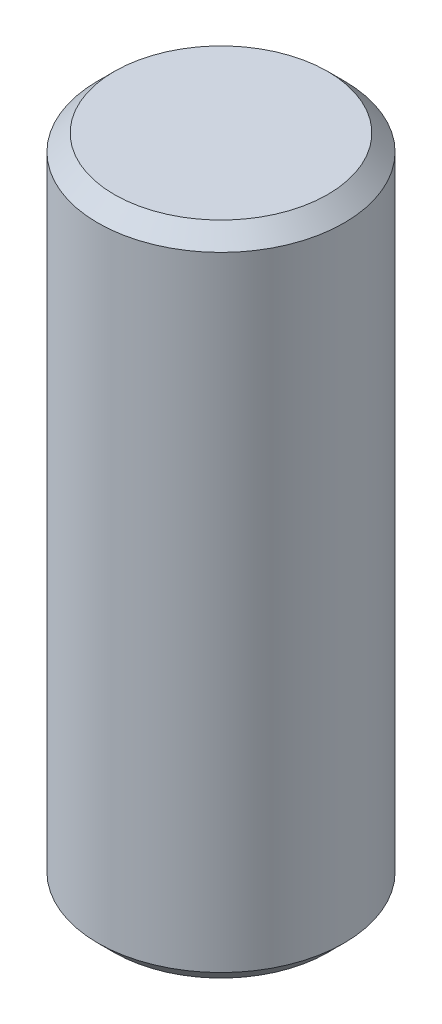
ISO-10303-21;
HEADER;
FILE_DESCRIPTION(('STEP AP214'),'2;1');
FILE_NAME('part.step','',(''),(''),'','','');
FILE_SCHEMA(('AUTOMOTIVE_DESIGN { 1 0 10303 214 1 1 1 1 }'));
ENDSEC;
DATA;
#1=APPLICATION_CONTEXT('core data for automotive mechanical design processes');
#2=APPLICATION_PROTOCOL_DEFINITION('international standard','automotive_design',2000,#1);
#3=PRODUCT_CONTEXT('',#1,'mechanical');
#4=PRODUCT('Part','Part','',(#3));
#5=PRODUCT_RELATED_PRODUCT_CATEGORY('part','',(#4));
#6=PRODUCT_DEFINITION_FORMATION('','',#4);
#7=PRODUCT_DEFINITION_CONTEXT('part definition',#1,'design');
#8=PRODUCT_DEFINITION('design','',#6,#7);
#9=PRODUCT_DEFINITION_SHAPE('','',#8);
#10=(LENGTH_UNIT() NAMED_UNIT(*) SI_UNIT(.MILLI.,.METRE.));
#11=(NAMED_UNIT(*) PLANE_ANGLE_UNIT() SI_UNIT($,.RADIAN.));
#12=(NAMED_UNIT(*) SI_UNIT($,.STERADIAN.) SOLID_ANGLE_UNIT());
#13=UNCERTAINTY_MEASURE_WITH_UNIT(LENGTH_MEASURE(1.E-05),#10,'distance_accuracy_value','');
#14=(GEOMETRIC_REPRESENTATION_CONTEXT(3) GLOBAL_UNCERTAINTY_ASSIGNED_CONTEXT((#13)) GLOBAL_UNIT_ASSIGNED_CONTEXT((#10,
#11,#12)) REPRESENTATION_CONTEXT('',''));
#15=CARTESIAN_POINT('',(0.,0.,0.));
#16=DIRECTION('',(0.,0.,1.));
#17=DIRECTION('',(1.,0.,0.));
#18=AXIS2_PLACEMENT_3D('',#15,#16,#17);
#19=CARTESIAN_POINT('',(0.,8.,0.));
#20=DIRECTION('',(0.,-1.,0.));
#21=DIRECTION('',(0.,0.,-1.));
#22=AXIS2_PLACEMENT_3D('',#19,#20,#21);
#23=CYLINDRICAL_SURFACE('',#22,1.5);
#24=CARTESIAN_POINT('',(0.,7.8,0.));
#25=DIRECTION('',(0.,1.,0.));
#26=DIRECTION('',(0.,0.,1.));
#27=AXIS2_PLACEMENT_3D('',#24,#25,#26);
#28=CIRCLE('',#27,1.5);
#29=CARTESIAN_POINT('',(0.,7.8,1.5));
#30=VERTEX_POINT('',#29);
#31=EDGE_CURVE('E43',#30,#30,#28,.F.);
#32=ORIENTED_EDGE('',*,*,#31,.T.);
#33=EDGE_LOOP('',(#32));
#34=FACE_BOUND('',#33,.T.);
#35=CARTESIAN_POINT('',(0.,0.200000000000001,0.));
#36=DIRECTION('',(0.,1.,0.));
#37=DIRECTION('',(0.,0.,1.));
#38=AXIS2_PLACEMENT_3D('',#35,#36,#37);
#39=CIRCLE('',#38,1.5);
#40=CARTESIAN_POINT('',(0.,0.200000000000001,1.5));
#41=VERTEX_POINT('',#40);
#42=EDGE_CURVE('E47',#41,#41,#39,.T.);
#43=ORIENTED_EDGE('',*,*,#42,.T.);
#44=EDGE_LOOP('',(#43));
#45=FACE_BOUND('',#44,.T.);
#46=ADVANCED_FACE('F35',(#34,#45),#23,.T.);
#47=CARTESIAN_POINT('',(0.,8.,0.));
#48=DIRECTION('',(0.,1.,0.));
#49=DIRECTION('',(0.,0.,1.));
#50=AXIS2_PLACEMENT_3D('',#47,#48,#49);
#51=PLANE('',#50);
#52=CARTESIAN_POINT('',(0.,8.,0.));
#53=DIRECTION('',(0.,1.,0.));
#54=DIRECTION('',(0.,0.,1.));
#55=AXIS2_PLACEMENT_3D('',#52,#53,#54);
#56=CIRCLE('',#55,1.3);
#57=CARTESIAN_POINT('',(0.,8.,1.3));
#58=VERTEX_POINT('',#57);
#59=EDGE_CURVE('E51',#58,#58,#56,.T.);
#60=ORIENTED_EDGE('',*,*,#59,.T.);
#61=EDGE_LOOP('',(#60));
#62=FACE_BOUND('',#61,.T.);
#63=ADVANCED_FACE('F57',(#62),#51,.T.);
#64=CARTESIAN_POINT('',(0.,0.,0.));
#65=DIRECTION('',(0.,1.,0.));
#66=DIRECTION('',(0.,0.,1.));
#67=AXIS2_PLACEMENT_3D('',#64,#65,#66);
#68=PLANE('',#67);
#69=CARTESIAN_POINT('',(0.,0.,0.));
#70=DIRECTION('',(0.,1.,0.));
#71=DIRECTION('',(0.,0.,1.));
#72=AXIS2_PLACEMENT_3D('',#69,#70,#71);
#73=CIRCLE('',#72,1.3);
#74=CARTESIAN_POINT('',(0.,0.,1.3));
#75=VERTEX_POINT('',#74);
#76=EDGE_CURVE('E10',#75,#75,#73,.F.);
#77=ORIENTED_EDGE('',*,*,#76,.T.);
#78=EDGE_LOOP('',(#77));
#79=FACE_BOUND('',#78,.T.);
#80=ADVANCED_FACE('F61',(#79),#68,.F.);
#81=CARTESIAN_POINT('',(0.,8.,0.));
#82=DIRECTION('',(0.,-1.,0.));
#83=DIRECTION('',(0.,0.,-1.));
#84=AXIS2_PLACEMENT_3D('',#81,#82,#83);
#85=CONICAL_SURFACE('',#84,1.3,0.78539816339745);
#86=ORIENTED_EDGE('',*,*,#31,.F.);
#87=EDGE_LOOP('',(#86));
#88=FACE_BOUND('',#87,.T.);
#89=ORIENTED_EDGE('',*,*,#59,.F.);
#90=EDGE_LOOP('',(#89));
#91=FACE_BOUND('',#90,.T.);
#92=ADVANCED_FACE('F59',(#88,#91),#85,.T.);
#93=CARTESIAN_POINT('',(0.,0.200000000000001,0.));
#94=DIRECTION('',(0.,1.,0.));
#95=DIRECTION('',(0.,0.,1.));
#96=AXIS2_PLACEMENT_3D('',#93,#94,#95);
#97=CONICAL_SURFACE('',#96,1.5,0.785398163397449);
#98=ORIENTED_EDGE('',*,*,#76,.F.);
#99=EDGE_LOOP('',(#98));
#100=FACE_BOUND('',#99,.T.);
#101=ORIENTED_EDGE('',*,*,#42,.F.);
#102=EDGE_LOOP('',(#101));
#103=FACE_BOUND('',#102,.T.);
#104=ADVANCED_FACE('F38',(#100,#103),#97,.T.);
#105=CLOSED_SHELL('',(#46,#63,#80,#92,#104));
#106=MANIFOLD_SOLID_BREP('B2',#105);
#107=ADVANCED_BREP_SHAPE_REPRESENTATION('',(#18,#106),#14);
#108=SHAPE_DEFINITION_REPRESENTATION(#9,#107);
ENDSEC;
END-ISO-10303-21;
